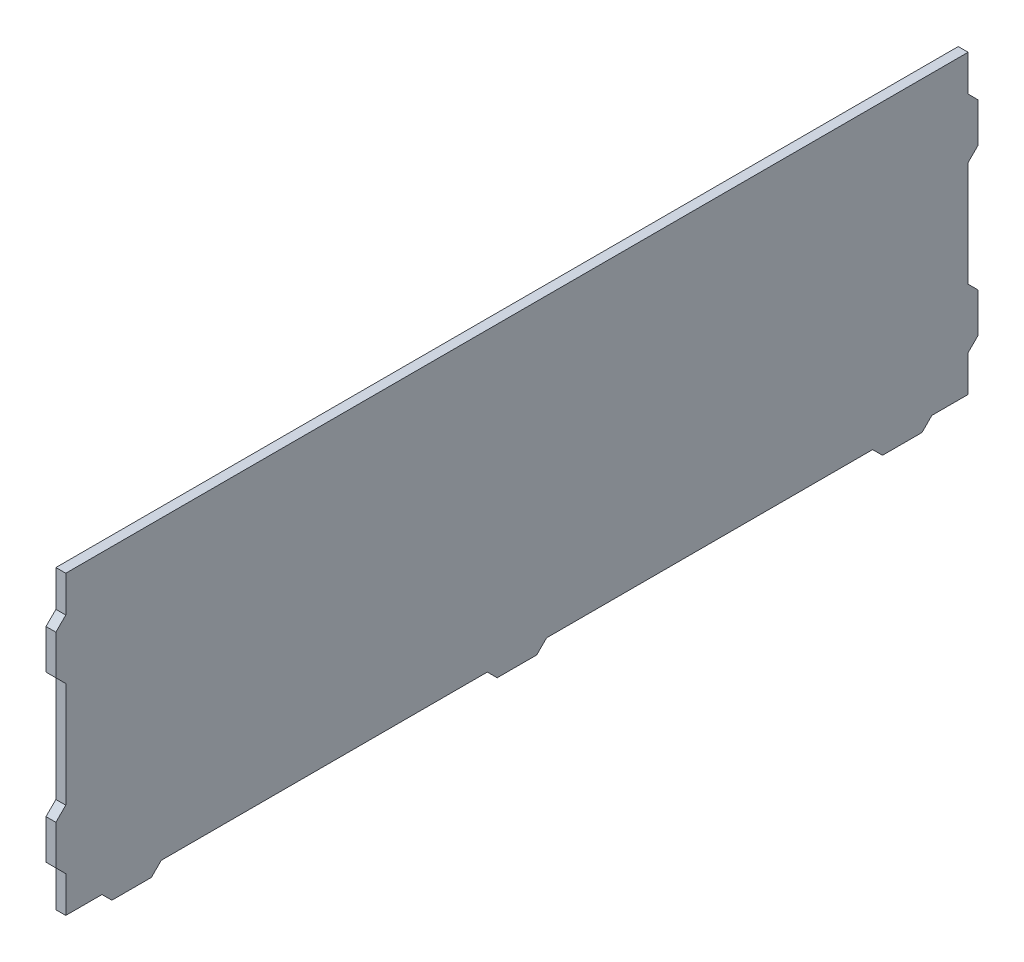
ISO-10303-21;
HEADER;
FILE_DESCRIPTION(('STEP AP214'),'2;1');
FILE_NAME('part.step','',(''),(''),'','','');
FILE_SCHEMA(('AUTOMOTIVE_DESIGN { 1 0 10303 214 1 1 1 1 }'));
ENDSEC;
DATA;
#1=APPLICATION_CONTEXT('core data for automotive mechanical design processes');
#2=APPLICATION_PROTOCOL_DEFINITION('international standard','automotive_design',2000,#1);
#3=PRODUCT_CONTEXT('',#1,'mechanical');
#4=PRODUCT('Part','Part','',(#3));
#5=PRODUCT_RELATED_PRODUCT_CATEGORY('part','',(#4));
#6=PRODUCT_DEFINITION_FORMATION('','',#4);
#7=PRODUCT_DEFINITION_CONTEXT('part definition',#1,'design');
#8=PRODUCT_DEFINITION('design','',#6,#7);
#9=PRODUCT_DEFINITION_SHAPE('','',#8);
#10=(LENGTH_UNIT() NAMED_UNIT(*) SI_UNIT(.MILLI.,.METRE.));
#11=(NAMED_UNIT(*) PLANE_ANGLE_UNIT() SI_UNIT($,.RADIAN.));
#12=(NAMED_UNIT(*) SI_UNIT($,.STERADIAN.) SOLID_ANGLE_UNIT());
#13=UNCERTAINTY_MEASURE_WITH_UNIT(LENGTH_MEASURE(1.E-05),#10,'distance_accuracy_value','');
#14=(GEOMETRIC_REPRESENTATION_CONTEXT(3) GLOBAL_UNCERTAINTY_ASSIGNED_CONTEXT((#13)) GLOBAL_UNIT_ASSIGNED_CONTEXT((#10,
#11,#12)) REPRESENTATION_CONTEXT('',''));
#15=CARTESIAN_POINT('',(0.,0.,0.));
#16=DIRECTION('',(0.,0.,1.));
#17=DIRECTION('',(1.,0.,0.));
#18=AXIS2_PLACEMENT_3D('',#15,#16,#17);
#19=CARTESIAN_POINT('',(1.5,0.,0.));
#20=DIRECTION('',(0.,1.,0.));
#21=DIRECTION('',(0.,0.,1.));
#22=AXIS2_PLACEMENT_3D('',#19,#20,#21);
#23=PLANE('',#22);
#24=DIRECTION('',(0.,0.,-1.));
#25=VECTOR('',#24,1.);
#26=CARTESIAN_POINT('',(0.,0.,0.));
#27=LINE('',#26,#25);
#28=CARTESIAN_POINT('',(0.,0.,0.));
#29=VERTEX_POINT('',#28);
#30=CARTESIAN_POINT('',(0.,-3.33066907387547E-13,-5.50000000000006));
#31=VERTEX_POINT('',#30);
#32=EDGE_CURVE('E554',#29,#31,#27,.T.);
#33=ORIENTED_EDGE('',*,*,#32,.T.);
#34=DIRECTION('',(1.,0.,0.));
#35=VECTOR('',#34,1.);
#36=CARTESIAN_POINT('',(0.750000000000056,-3.33066907387547E-13,-5.50000000000006));
#37=LINE('',#36,#35);
#38=CARTESIAN_POINT('',(1.50000000000006,-3.33066907387547E-13,-5.50000000000006));
#39=VERTEX_POINT('',#38);
#40=EDGE_CURVE('E342',#31,#39,#37,.T.);
#41=ORIENTED_EDGE('',*,*,#40,.T.);
#42=DIRECTION('',(0.,0.,-1.));
#43=VECTOR('',#42,1.);
#44=CARTESIAN_POINT('',(1.5,0.,0.));
#45=LINE('',#44,#43);
#46=CARTESIAN_POINT('',(1.5,0.,0.));
#47=VERTEX_POINT('',#46);
#48=EDGE_CURVE('E537',#47,#39,#45,.T.);
#49=ORIENTED_EDGE('',*,*,#48,.F.);
#50=DIRECTION('',(-1.,0.,0.));
#51=VECTOR('',#50,1.);
#52=CARTESIAN_POINT('',(1.5,0.,0.));
#53=LINE('',#52,#51);
#54=EDGE_CURVE('E13',#47,#29,#53,.T.);
#55=ORIENTED_EDGE('',*,*,#54,.T.);
#56=EDGE_LOOP('',(#33,#41,#49,#55));
#57=FACE_BOUND('',#56,.T.);
#58=ADVANCED_FACE('F126',(#57),#23,.F.);
#59=CARTESIAN_POINT('',(1.50000000000006,-1.11022302462516E-13,-14.5000000000001));
#60=VERTEX_POINT('',#59);
#61=CARTESIAN_POINT('',(1.50000000000006,-1.11022302462516E-13,-63.9999999999999));
#62=VERTEX_POINT('',#61);
#63=EDGE_CURVE('E541',#60,#62,#45,.T.);
#64=ORIENTED_EDGE('',*,*,#63,.F.);
#65=DIRECTION('',(-1.,0.,0.));
#66=VECTOR('',#65,1.);
#67=CARTESIAN_POINT('',(0.750000000000056,-1.11022302462516E-13,-14.5000000000001));
#68=LINE('',#67,#66);
#69=CARTESIAN_POINT('',(0.,-1.11022302462516E-13,-14.5000000000001));
#70=VERTEX_POINT('',#69);
#71=EDGE_CURVE('E347',#60,#70,#68,.T.);
#72=ORIENTED_EDGE('',*,*,#71,.T.);
#73=CARTESIAN_POINT('',(0.,-1.11022302462516E-13,-63.9999999999999));
#74=VERTEX_POINT('',#73);
#75=EDGE_CURVE('E557',#70,#74,#27,.T.);
#76=ORIENTED_EDGE('',*,*,#75,.T.);
#77=DIRECTION('',(1.,0.,0.));
#78=VECTOR('',#77,1.);
#79=CARTESIAN_POINT('',(0.750000000000056,-1.11022302462516E-13,-63.9999999999999));
#80=LINE('',#79,#78);
#81=EDGE_CURVE('E391',#74,#62,#80,.T.);
#82=ORIENTED_EDGE('',*,*,#81,.T.);
#83=EDGE_LOOP('',(#64,#72,#76,#82));
#84=FACE_BOUND('',#83,.T.);
#85=ADVANCED_FACE('F598',(#84),#23,.F.);
#86=CARTESIAN_POINT('',(1.50000000000006,-3.33066907387547E-13,-73.));
#87=VERTEX_POINT('',#86);
#88=CARTESIAN_POINT('',(1.50000000000006,-2.22044604925031E-13,-122.5));
#89=VERTEX_POINT('',#88);
#90=EDGE_CURVE('E587',#87,#89,#45,.T.);
#91=ORIENTED_EDGE('',*,*,#90,.F.);
#92=DIRECTION('',(-1.,0.,0.));
#93=VECTOR('',#92,1.);
#94=CARTESIAN_POINT('',(0.750000000000056,-3.33066907387547E-13,-73.));
#95=LINE('',#94,#93);
#96=CARTESIAN_POINT('',(0.,-3.33066907387547E-13,-73.));
#97=VERTEX_POINT('',#96);
#98=EDGE_CURVE('E389',#87,#97,#95,.T.);
#99=ORIENTED_EDGE('',*,*,#98,.T.);
#100=CARTESIAN_POINT('',(0.,-2.22044604925031E-13,-122.5));
#101=VERTEX_POINT('',#100);
#102=EDGE_CURVE('E599',#97,#101,#27,.T.);
#103=ORIENTED_EDGE('',*,*,#102,.T.);
#104=DIRECTION('',(1.,0.,0.));
#105=VECTOR('',#104,1.);
#106=CARTESIAN_POINT('',(0.750000000000056,-2.22044604925031E-13,-122.5));
#107=LINE('',#106,#105);
#108=EDGE_CURVE('E418',#101,#89,#107,.T.);
#109=ORIENTED_EDGE('',*,*,#108,.T.);
#110=EDGE_LOOP('',(#91,#99,#103,#109));
#111=FACE_BOUND('',#110,.T.);
#112=ADVANCED_FACE('F606',(#111),#23,.F.);
#113=CARTESIAN_POINT('',(1.5,0.,0.));
#114=DIRECTION('',(0.,0.,-1.));
#115=DIRECTION('',(-1.,0.,0.));
#116=AXIS2_PLACEMENT_3D('',#113,#114,#115);
#117=PLANE('',#116);
#118=DIRECTION('',(0.,-1.,0.));
#119=VECTOR('',#118,1.);
#120=CARTESIAN_POINT('',(1.5,0.,0.));
#121=LINE('',#120,#119);
#122=CARTESIAN_POINT('',(1.50000000000006,30.4999999999999,0.));
#123=VERTEX_POINT('',#122);
#124=CARTESIAN_POINT('',(1.50000000000006,14.4999999999996,2.22044604925031E-13));
#125=VERTEX_POINT('',#124);
#126=EDGE_CURVE('E535',#123,#125,#121,.T.);
#127=ORIENTED_EDGE('',*,*,#126,.F.);
#128=DIRECTION('',(1.,0.,0.));
#129=VECTOR('',#128,1.);
#130=CARTESIAN_POINT('',(0.750000000000056,30.4999999999999,0.));
#131=LINE('',#130,#129);
#132=CARTESIAN_POINT('',(0.,30.4999999999999,0.));
#133=VERTEX_POINT('',#132);
#134=EDGE_CURVE('E434',#123,#133,#131,.F.);
#135=ORIENTED_EDGE('',*,*,#134,.T.);
#136=DIRECTION('',(0.,-1.,0.));
#137=VECTOR('',#136,1.);
#138=CARTESIAN_POINT('',(0.,0.,0.));
#139=LINE('',#138,#137);
#140=CARTESIAN_POINT('',(0.,14.4999999999996,2.22044604925031E-13));
#141=VERTEX_POINT('',#140);
#142=EDGE_CURVE('E553',#133,#141,#139,.T.);
#143=ORIENTED_EDGE('',*,*,#142,.T.);
#144=DIRECTION('',(-1.,0.,0.));
#145=VECTOR('',#144,1.);
#146=CARTESIAN_POINT('',(0.750000000000056,14.4999999999996,2.22044604925031E-13));
#147=LINE('',#146,#145);
#148=EDGE_CURVE('E455',#141,#125,#147,.F.);
#149=ORIENTED_EDGE('',*,*,#148,.T.);
#150=EDGE_LOOP('',(#127,#135,#143,#149));
#151=FACE_BOUND('',#150,.T.);
#152=ADVANCED_FACE('F628',(#151),#117,.F.);
#153=CARTESIAN_POINT('',(1.50000000000006,5.49999999999984,-1.11022302462516E-13));
#154=VERTEX_POINT('',#153);
#155=EDGE_CURVE('E536',#154,#47,#121,.T.);
#156=ORIENTED_EDGE('',*,*,#155,.F.);
#157=DIRECTION('',(1.,0.,0.));
#158=VECTOR('',#157,1.);
#159=CARTESIAN_POINT('',(0.750000000000056,5.49999999999984,-1.11022302462516E-13));
#160=LINE('',#159,#158);
#161=CARTESIAN_POINT('',(0.,5.49999999999984,-1.11022302462516E-13));
#162=VERTEX_POINT('',#161);
#163=EDGE_CURVE('E460',#154,#162,#160,.F.);
#164=ORIENTED_EDGE('',*,*,#163,.T.);
#165=EDGE_CURVE('E530',#162,#29,#139,.T.);
#166=ORIENTED_EDGE('',*,*,#165,.T.);
#167=ORIENTED_EDGE('',*,*,#54,.F.);
#168=EDGE_LOOP('',(#156,#164,#166,#167));
#169=FACE_BOUND('',#168,.T.);
#170=ADVANCED_FACE('F629',(#169),#117,.F.);
#171=CARTESIAN_POINT('',(1.50000000000006,-1.11022302462516E-13,-137.));
#172=DIRECTION('',(0.,0.,1.));
#173=DIRECTION('',(1.,0.,0.));
#174=AXIS2_PLACEMENT_3D('',#171,#172,#173);
#175=PLANE('',#174);
#176=DIRECTION('',(0.,1.,0.));
#177=VECTOR('',#176,1.);
#178=CARTESIAN_POINT('',(1.50000000000006,-1.11022302462516E-13,-137.));
#179=LINE('',#178,#177);
#180=CARTESIAN_POINT('',(1.50000000000006,39.4999999999996,-137.));
#181=VERTEX_POINT('',#180);
#182=CARTESIAN_POINT('',(1.50000000000006,44.9999999999998,-137.000000000001));
#183=VERTEX_POINT('',#182);
#184=EDGE_CURVE('E540',#181,#183,#179,.T.);
#185=ORIENTED_EDGE('',*,*,#184,.F.);
#186=DIRECTION('',(-1.,0.,0.));
#187=VECTOR('',#186,1.);
#188=CARTESIAN_POINT('',(150.,39.4999999999998,-137.));
#189=LINE('',#188,#187);
#190=CARTESIAN_POINT('',(0.,39.4999999999996,-137.));
#191=VERTEX_POINT('',#190);
#192=EDGE_CURVE('E497',#181,#191,#189,.T.);
#193=ORIENTED_EDGE('',*,*,#192,.T.);
#194=DIRECTION('',(0.,1.,0.));
#195=VECTOR('',#194,1.);
#196=CARTESIAN_POINT('',(0.,-1.11022302462516E-13,-137.));
#197=LINE('',#196,#195);
#198=CARTESIAN_POINT('',(0.,44.9999999999998,-137.000000000001));
#199=VERTEX_POINT('',#198);
#200=EDGE_CURVE('E556',#191,#199,#197,.T.);
#201=ORIENTED_EDGE('',*,*,#200,.T.);
#202=DIRECTION('',(-1.,0.,0.));
#203=VECTOR('',#202,1.);
#204=CARTESIAN_POINT('',(1.50000000000006,44.9999999999998,-137.000000000001));
#205=LINE('',#204,#203);
#206=EDGE_CURVE('E566',#183,#199,#205,.T.);
#207=ORIENTED_EDGE('',*,*,#206,.F.);
#208=EDGE_LOOP('',(#185,#193,#201,#207));
#209=FACE_BOUND('',#208,.T.);
#210=ADVANCED_FACE('F625',(#209),#175,.F.);
#211=CARTESIAN_POINT('',(0.,14.4999999999997,-137.));
#212=VERTEX_POINT('',#211);
#213=CARTESIAN_POINT('',(0.,30.4999999999999,-137.));
#214=VERTEX_POINT('',#213);
#215=EDGE_CURVE('E562',#212,#214,#197,.T.);
#216=ORIENTED_EDGE('',*,*,#215,.T.);
#217=DIRECTION('',(1.,0.,0.));
#218=VECTOR('',#217,1.);
#219=CARTESIAN_POINT('',(150.,30.4999999999999,-137.));
#220=LINE('',#219,#218);
#221=CARTESIAN_POINT('',(1.50000000000006,30.4999999999999,-137.));
#222=VERTEX_POINT('',#221);
#223=EDGE_CURVE('E494',#214,#222,#220,.T.);
#224=ORIENTED_EDGE('',*,*,#223,.T.);
#225=CARTESIAN_POINT('',(1.50000000000006,14.4999999999997,-137.));
#226=VERTEX_POINT('',#225);
#227=EDGE_CURVE('E546',#226,#222,#179,.T.);
#228=ORIENTED_EDGE('',*,*,#227,.F.);
#229=DIRECTION('',(-1.,0.,0.));
#230=VECTOR('',#229,1.);
#231=CARTESIAN_POINT('',(150.,14.5000000000001,-137.000000000001));
#232=LINE('',#231,#230);
#233=EDGE_CURVE('E523',#226,#212,#232,.T.);
#234=ORIENTED_EDGE('',*,*,#233,.T.);
#235=EDGE_LOOP('',(#216,#224,#228,#234));
#236=FACE_BOUND('',#235,.T.);
#237=ADVANCED_FACE('F626',(#236),#175,.F.);
#238=CARTESIAN_POINT('',(0.,44.9999999999997,0.));
#239=VERTEX_POINT('',#238);
#240=CARTESIAN_POINT('',(0.,39.5,0.));
#241=VERTEX_POINT('',#240);
#242=EDGE_CURVE('E549',#239,#241,#139,.T.);
#243=ORIENTED_EDGE('',*,*,#242,.T.);
#244=DIRECTION('',(-1.,0.,0.));
#245=VECTOR('',#244,1.);
#246=CARTESIAN_POINT('',(0.750000000000056,39.5,0.));
#247=LINE('',#246,#245);
#248=CARTESIAN_POINT('',(1.50000000000006,39.5,0.));
#249=VERTEX_POINT('',#248);
#250=EDGE_CURVE('E429',#241,#249,#247,.F.);
#251=ORIENTED_EDGE('',*,*,#250,.T.);
#252=CARTESIAN_POINT('',(1.50000000000006,44.9999999999997,0.));
#253=VERTEX_POINT('',#252);
#254=EDGE_CURVE('E531',#253,#249,#121,.T.);
#255=ORIENTED_EDGE('',*,*,#254,.F.);
#256=DIRECTION('',(-1.,0.,0.));
#257=VECTOR('',#256,1.);
#258=CARTESIAN_POINT('',(1.50000000000006,44.9999999999997,0.));
#259=LINE('',#258,#257);
#260=EDGE_CURVE('E548',#253,#239,#259,.T.);
#261=ORIENTED_EDGE('',*,*,#260,.T.);
#262=EDGE_LOOP('',(#243,#251,#255,#261));
#263=FACE_BOUND('',#262,.T.);
#264=ADVANCED_FACE('F128',(#263),#117,.F.);
#265=CARTESIAN_POINT('',(1.50000000000006,0.,-131.5));
#266=VERTEX_POINT('',#265);
#267=CARTESIAN_POINT('',(1.50000000000006,-1.11022302462516E-13,-137.));
#268=VERTEX_POINT('',#267);
#269=EDGE_CURVE('E534',#266,#268,#45,.T.);
#270=ORIENTED_EDGE('',*,*,#269,.F.);
#271=DIRECTION('',(-1.,0.,0.));
#272=VECTOR('',#271,1.);
#273=CARTESIAN_POINT('',(0.750000000000056,0.,-131.5));
#274=LINE('',#273,#272);
#275=CARTESIAN_POINT('',(0.,0.,-131.5));
#276=VERTEX_POINT('',#275);
#277=EDGE_CURVE('E415',#266,#276,#274,.T.);
#278=ORIENTED_EDGE('',*,*,#277,.T.);
#279=CARTESIAN_POINT('',(0.,-1.11022302462516E-13,-137.));
#280=VERTEX_POINT('',#279);
#281=EDGE_CURVE('E552',#276,#280,#27,.T.);
#282=ORIENTED_EDGE('',*,*,#281,.T.);
#283=DIRECTION('',(-1.,0.,0.));
#284=VECTOR('',#283,1.);
#285=CARTESIAN_POINT('',(1.50000000000006,-1.11022302462516E-13,-137.));
#286=LINE('',#285,#284);
#287=EDGE_CURVE('E134',#268,#280,#286,.T.);
#288=ORIENTED_EDGE('',*,*,#287,.F.);
#289=EDGE_LOOP('',(#270,#278,#282,#288));
#290=FACE_BOUND('',#289,.T.);
#291=ADVANCED_FACE('F617',(#290),#23,.F.);
#292=CARTESIAN_POINT('',(0.,5.49999999999962,-137.));
#293=VERTEX_POINT('',#292);
#294=EDGE_CURVE('E558',#280,#293,#197,.T.);
#295=ORIENTED_EDGE('',*,*,#294,.T.);
#296=DIRECTION('',(1.,0.,0.));
#297=VECTOR('',#296,1.);
#298=CARTESIAN_POINT('',(150.,5.49999999999962,-137.));
#299=LINE('',#298,#297);
#300=CARTESIAN_POINT('',(1.50000000000006,5.49999999999962,-137.));
#301=VERTEX_POINT('',#300);
#302=EDGE_CURVE('E520',#293,#301,#299,.T.);
#303=ORIENTED_EDGE('',*,*,#302,.T.);
#304=EDGE_CURVE('E542',#268,#301,#179,.T.);
#305=ORIENTED_EDGE('',*,*,#304,.F.);
#306=ORIENTED_EDGE('',*,*,#287,.T.);
#307=EDGE_LOOP('',(#295,#303,#305,#306));
#308=FACE_BOUND('',#307,.T.);
#309=ADVANCED_FACE('F573',(#308),#175,.F.);
#310=CARTESIAN_POINT('',(1.50000000000006,44.9999999999997,0.));
#311=DIRECTION('',(0.,-1.,0.));
#312=DIRECTION('',(0.,0.,-1.));
#313=AXIS2_PLACEMENT_3D('',#310,#311,#312);
#314=PLANE('',#313);
#315=DIRECTION('',(0.,0.,1.));
#316=VECTOR('',#315,1.);
#317=CARTESIAN_POINT('',(0.,44.9999999999997,0.));
#318=LINE('',#317,#316);
#319=EDGE_CURVE('E561',#199,#239,#318,.T.);
#320=ORIENTED_EDGE('',*,*,#319,.T.);
#321=ORIENTED_EDGE('',*,*,#260,.F.);
#322=DIRECTION('',(0.,0.,1.));
#323=VECTOR('',#322,1.);
#324=CARTESIAN_POINT('',(1.50000000000006,44.9999999999997,0.));
#325=LINE('',#324,#323);
#326=EDGE_CURVE('E545',#183,#253,#325,.T.);
#327=ORIENTED_EDGE('',*,*,#326,.F.);
#328=ORIENTED_EDGE('',*,*,#206,.T.);
#329=EDGE_LOOP('',(#320,#321,#327,#328));
#330=FACE_BOUND('',#329,.T.);
#331=ADVANCED_FACE('F623',(#330),#314,.F.);
#332=CARTESIAN_POINT('',(1.5,0.,0.));
#333=DIRECTION('',(-1.,0.,0.));
#334=DIRECTION('',(0.,0.,1.));
#335=AXIS2_PLACEMENT_3D('',#332,#333,#334);
#336=PLANE('',#335);
#337=ORIENTED_EDGE('',*,*,#254,.T.);
#338=DIRECTION('',(0.,0.707106781186548,-0.707106781186548));
#339=VECTOR('',#338,1.);
#340=CARTESIAN_POINT('',(1.50000000000006,39.9999999999996,-0.499999999999945));
#341=LINE('',#340,#339);
#342=CARTESIAN_POINT('',(1.50000000000006,37.9999999999998,1.50000000000039));
#343=VERTEX_POINT('',#342);
#344=EDGE_CURVE('E447',#249,#343,#341,.F.);
#345=ORIENTED_EDGE('',*,*,#344,.T.);
#346=DIRECTION('',(0.,-1.,0.));
#347=VECTOR('',#346,1.);
#348=CARTESIAN_POINT('',(1.50000000000006,29.9999999999998,1.50000000000017));
#349=LINE('',#348,#347);
#350=CARTESIAN_POINT('',(1.50000000000006,31.9999999999999,1.49999999999983));
#351=VERTEX_POINT('',#350);
#352=EDGE_CURVE('E426',#343,#351,#349,.T.);
#353=ORIENTED_EDGE('',*,*,#352,.T.);
#354=DIRECTION('',(0.,0.707106781186547,0.707106781186548));
#355=VECTOR('',#354,1.);
#356=CARTESIAN_POINT('',(1.50000000000006,29.9999999999997,-0.499999999999501));
#357=LINE('',#356,#355);
#358=EDGE_CURVE('E449',#351,#123,#357,.F.);
#359=ORIENTED_EDGE('',*,*,#358,.T.);
#360=ORIENTED_EDGE('',*,*,#126,.T.);
#361=DIRECTION('',(0.,0.707106781186548,-0.707106781186548));
#362=VECTOR('',#361,1.);
#363=CARTESIAN_POINT('',(1.50000000000006,14.9999999999998,-0.499999999999501));
#364=LINE('',#363,#362);
#365=CARTESIAN_POINT('',(1.50000000000006,12.9999999999997,1.5000000000005));
#366=VERTEX_POINT('',#365);
#367=EDGE_CURVE('E474',#125,#366,#364,.F.);
#368=ORIENTED_EDGE('',*,*,#367,.T.);
#369=DIRECTION('',(0.,-1.,0.));
#370=VECTOR('',#369,1.);
#371=CARTESIAN_POINT('',(1.50000000000006,5.,1.49999999999983));
#372=LINE('',#371,#370);
#373=CARTESIAN_POINT('',(1.50000000000006,6.9999999999999,1.49999999999995));
#374=VERTEX_POINT('',#373);
#375=EDGE_CURVE('E452',#366,#374,#372,.T.);
#376=ORIENTED_EDGE('',*,*,#375,.T.);
#377=DIRECTION('',(0.,0.707106781186548,0.707106781186548));
#378=VECTOR('',#377,1.);
#379=CARTESIAN_POINT('',(1.50000000000006,4.99999999999978,-0.500000000000167));
#380=LINE('',#379,#378);
#381=EDGE_CURVE('E476',#374,#154,#380,.F.);
#382=ORIENTED_EDGE('',*,*,#381,.T.);
#383=ORIENTED_EDGE('',*,*,#155,.T.);
#384=ORIENTED_EDGE('',*,*,#48,.T.);
#385=DIRECTION('',(0.,-0.707106781186548,-0.707106781186548));
#386=VECTOR('',#385,1.);
#387=CARTESIAN_POINT('',(1.5,-1.5000000000005,-6.9999999999999));
#388=LINE('',#387,#386);
#389=CARTESIAN_POINT('',(1.5,-1.5000000000005,-6.9999999999999));
#390=VERTEX_POINT('',#389);
#391=EDGE_CURVE('E371',#39,#390,#388,.T.);
#392=ORIENTED_EDGE('',*,*,#391,.T.);
#393=DIRECTION('',(0.,0.,1.));
#394=VECTOR('',#393,1.);
#395=CARTESIAN_POINT('',(1.50000000000006,-1.49999999999995,-14.9999999999999));
#396=LINE('',#395,#394);
#397=CARTESIAN_POINT('',(1.50000000000006,-1.50000000000039,-12.9999999999999));
#398=VERTEX_POINT('',#397);
#399=EDGE_CURVE('E356',#398,#390,#396,.T.);
#400=ORIENTED_EDGE('',*,*,#399,.F.);
#401=DIRECTION('',(0.,0.70710678118655,-0.707106781186545));
#402=VECTOR('',#401,1.);
#403=CARTESIAN_POINT('',(1.50000000000006,-1.50000000000039,-12.9999999999999));
#404=LINE('',#403,#402);
#405=EDGE_CURVE('E369',#398,#60,#404,.T.);
#406=ORIENTED_EDGE('',*,*,#405,.T.);
#407=ORIENTED_EDGE('',*,*,#63,.T.);
#408=DIRECTION('',(0.,-0.707106781186547,-0.707106781186548));
#409=VECTOR('',#408,1.);
#410=CARTESIAN_POINT('',(1.50000000000006,-1.50000000000017,-65.5000000000002));
#411=LINE('',#410,#409);
#412=CARTESIAN_POINT('',(1.50000000000006,-1.50000000000017,-65.5000000000002));
#413=VERTEX_POINT('',#412);
#414=EDGE_CURVE('E396',#62,#413,#411,.T.);
#415=ORIENTED_EDGE('',*,*,#414,.T.);
#416=DIRECTION('',(0.,0.,1.));
#417=VECTOR('',#416,1.);
#418=CARTESIAN_POINT('',(1.50000000000006,-1.50000000000006,-73.5000000000001));
#419=LINE('',#418,#417);
#420=CARTESIAN_POINT('',(1.50000000000006,-1.50000000000028,-71.4999999999999));
#421=VERTEX_POINT('',#420);
#422=EDGE_CURVE('E374',#421,#413,#419,.T.);
#423=ORIENTED_EDGE('',*,*,#422,.F.);
#424=DIRECTION('',(0.,0.707106781186548,-0.707106781186548));
#425=VECTOR('',#424,1.);
#426=CARTESIAN_POINT('',(1.50000000000006,-1.50000000000028,-71.4999999999999));
#427=LINE('',#426,#425);
#428=EDGE_CURVE('E394',#421,#87,#427,.T.);
#429=ORIENTED_EDGE('',*,*,#428,.T.);
#430=ORIENTED_EDGE('',*,*,#90,.T.);
#431=DIRECTION('',(0.,-0.70710678118655,-0.707106781186546));
#432=VECTOR('',#431,1.);
#433=CARTESIAN_POINT('',(1.50000000000006,-1.50000000000006,-124.));
#434=LINE('',#433,#432);
#435=CARTESIAN_POINT('',(1.50000000000006,-1.50000000000006,-124.));
#436=VERTEX_POINT('',#435);
#437=EDGE_CURVE('E423',#89,#436,#434,.T.);
#438=ORIENTED_EDGE('',*,*,#437,.T.);
#439=DIRECTION('',(0.,0.,1.));
#440=VECTOR('',#439,1.);
#441=CARTESIAN_POINT('',(1.50000000000006,-1.50000000000017,-132.));
#442=LINE('',#441,#440);
#443=CARTESIAN_POINT('',(1.50000000000006,-1.50000000000006,-130.000000000001));
#444=VERTEX_POINT('',#443);
#445=EDGE_CURVE('E399',#444,#436,#442,.T.);
#446=ORIENTED_EDGE('',*,*,#445,.F.);
#447=DIRECTION('',(0.,0.707106781186548,-0.707106781186548));
#448=VECTOR('',#447,1.);
#449=CARTESIAN_POINT('',(1.50000000000006,-1.50000000000006,-130.000000000001));
#450=LINE('',#449,#448);
#451=EDGE_CURVE('E421',#444,#266,#450,.T.);
#452=ORIENTED_EDGE('',*,*,#451,.T.);
#453=ORIENTED_EDGE('',*,*,#269,.T.);
#454=ORIENTED_EDGE('',*,*,#304,.T.);
#455=DIRECTION('',(0.,0.707106781186547,-0.707106781186549));
#456=VECTOR('',#455,1.);
#457=CARTESIAN_POINT('',(1.50000000000006,6.74999999999981,-138.25));
#458=LINE('',#457,#456);
#459=CARTESIAN_POINT('',(1.50000000000006,6.99999999999978,-138.5));
#460=VERTEX_POINT('',#459);
#461=EDGE_CURVE('E516',#301,#460,#458,.T.);
#462=ORIENTED_EDGE('',*,*,#461,.T.);
#463=DIRECTION('',(0.,-1.,0.));
#464=VECTOR('',#463,1.);
#465=CARTESIAN_POINT('',(1.50000000000006,5.,-138.500000000001));
#466=LINE('',#465,#464);
#467=CARTESIAN_POINT('',(1.50000000000006,12.9999999999998,-138.5));
#468=VERTEX_POINT('',#467);
#469=EDGE_CURVE('E507',#468,#460,#466,.T.);
#470=ORIENTED_EDGE('',*,*,#469,.F.);
#471=DIRECTION('',(0.,0.707106781186547,0.707106781186549));
#472=VECTOR('',#471,1.);
#473=CARTESIAN_POINT('',(1.50000000000006,8.24999999999987,-143.25));
#474=LINE('',#473,#472);
#475=EDGE_CURVE('E518',#468,#226,#474,.T.);
#476=ORIENTED_EDGE('',*,*,#475,.T.);
#477=ORIENTED_EDGE('',*,*,#227,.T.);
#478=DIRECTION('',(0.,0.707106781186548,-0.707106781186548));
#479=VECTOR('',#478,1.);
#480=CARTESIAN_POINT('',(1.50000000000006,31.7499999999999,-138.25));
#481=LINE('',#480,#479);
#482=CARTESIAN_POINT('',(1.50000000000006,31.9999999999997,-138.5));
#483=VERTEX_POINT('',#482);
#484=EDGE_CURVE('E490',#222,#483,#481,.T.);
#485=ORIENTED_EDGE('',*,*,#484,.T.);
#486=DIRECTION('',(0.,-1.,0.));
#487=VECTOR('',#486,1.);
#488=CARTESIAN_POINT('',(1.50000000000006,29.9999999999999,-138.5));
#489=LINE('',#488,#487);
#490=CARTESIAN_POINT('',(1.50000000000006,37.9999999999998,-138.5));
#491=VERTEX_POINT('',#490);
#492=EDGE_CURVE('E481',#491,#483,#489,.T.);
#493=ORIENTED_EDGE('',*,*,#492,.F.);
#494=DIRECTION('',(0.,0.707106781186547,0.707106781186548));
#495=VECTOR('',#494,1.);
#496=CARTESIAN_POINT('',(1.50000000000006,33.2499999999997,-143.250000000001));
#497=LINE('',#496,#495);
#498=EDGE_CURVE('E492',#491,#181,#497,.T.);
#499=ORIENTED_EDGE('',*,*,#498,.T.);
#500=ORIENTED_EDGE('',*,*,#184,.T.);
#501=ORIENTED_EDGE('',*,*,#326,.T.);
#502=EDGE_LOOP('',(#337,#345,#353,#359,#360,#368,#376,#382,#383,#384,#392,#400,#406,#407,#415,
#423,#429,#430,#438,#446,#452,#453,#454,#462,#470,#476,#477,#485,#493,#499,#500,#501));
#503=FACE_BOUND('',#502,.T.);
#504=ADVANCED_FACE('F583',(#503),#336,.F.);
#505=CARTESIAN_POINT('',(0.,0.,0.));
#506=DIRECTION('',(-1.,0.,0.));
#507=DIRECTION('',(0.,0.,1.));
#508=AXIS2_PLACEMENT_3D('',#505,#506,#507);
#509=PLANE('',#508);
#510=ORIENTED_EDGE('',*,*,#242,.F.);
#511=ORIENTED_EDGE('',*,*,#319,.F.);
#512=ORIENTED_EDGE('',*,*,#200,.F.);
#513=DIRECTION('',(0.,-0.707106781186547,-0.707106781186548));
#514=VECTOR('',#513,1.);
#515=CARTESIAN_POINT('',(0.,38.2499999999998,-138.25));
#516=LINE('',#515,#514);
#517=CARTESIAN_POINT('',(0.,37.9999999999998,-138.5));
#518=VERTEX_POINT('',#517);
#519=EDGE_CURVE('E502',#191,#518,#516,.T.);
#520=ORIENTED_EDGE('',*,*,#519,.T.);
#521=DIRECTION('',(0.,1.,0.));
#522=VECTOR('',#521,1.);
#523=CARTESIAN_POINT('',(0.,39.9999999999995,-138.500000000001));
#524=LINE('',#523,#522);
#525=CARTESIAN_POINT('',(0.,31.9999999999997,-138.5));
#526=VERTEX_POINT('',#525);
#527=EDGE_CURVE('E478',#526,#518,#524,.T.);
#528=ORIENTED_EDGE('',*,*,#527,.F.);
#529=DIRECTION('',(0.,-0.707106781186548,0.707106781186548));
#530=VECTOR('',#529,1.);
#531=CARTESIAN_POINT('',(0.,36.7499999999998,-143.25));
#532=LINE('',#531,#530);
#533=EDGE_CURVE('E500',#526,#214,#532,.T.);
#534=ORIENTED_EDGE('',*,*,#533,.T.);
#535=ORIENTED_EDGE('',*,*,#215,.F.);
#536=DIRECTION('',(0.,-0.707106781186547,-0.707106781186549));
#537=VECTOR('',#536,1.);
#538=CARTESIAN_POINT('',(0.,13.2499999999997,-138.25));
#539=LINE('',#538,#537);
#540=CARTESIAN_POINT('',(0.,12.9999999999998,-138.5));
#541=VERTEX_POINT('',#540);
#542=EDGE_CURVE('E528',#212,#541,#539,.T.);
#543=ORIENTED_EDGE('',*,*,#542,.T.);
#544=DIRECTION('',(0.,1.,0.));
#545=VECTOR('',#544,1.);
#546=CARTESIAN_POINT('',(0.,15.,-138.5));
#547=LINE('',#546,#545);
#548=CARTESIAN_POINT('',(0.,6.99999999999978,-138.5));
#549=VERTEX_POINT('',#548);
#550=EDGE_CURVE('E504',#549,#541,#547,.T.);
#551=ORIENTED_EDGE('',*,*,#550,.F.);
#552=DIRECTION('',(0.,-0.707106781186547,0.707106781186549));
#553=VECTOR('',#552,1.);
#554=CARTESIAN_POINT('',(0.,11.7499999999998,-143.250000000001));
#555=LINE('',#554,#553);
#556=EDGE_CURVE('E526',#549,#293,#555,.T.);
#557=ORIENTED_EDGE('',*,*,#556,.T.);
#558=ORIENTED_EDGE('',*,*,#294,.F.);
#559=ORIENTED_EDGE('',*,*,#281,.F.);
#560=DIRECTION('',(0.,-0.707106781186548,0.707106781186548));
#561=VECTOR('',#560,1.);
#562=CARTESIAN_POINT('',(0.,-1.50000000000006,-130.000000000001));
#563=LINE('',#562,#561);
#564=CARTESIAN_POINT('',(0.,-1.50000000000006,-130.000000000001));
#565=VERTEX_POINT('',#564);
#566=EDGE_CURVE('E410',#276,#565,#563,.T.);
#567=ORIENTED_EDGE('',*,*,#566,.T.);
#568=DIRECTION('',(0.,0.,-1.));
#569=VECTOR('',#568,1.);
#570=CARTESIAN_POINT('',(0.,-1.50000000000006,-122.));
#571=LINE('',#570,#569);
#572=CARTESIAN_POINT('',(0.,-1.50000000000006,-124.));
#573=VERTEX_POINT('',#572);
#574=EDGE_CURVE('E398',#573,#565,#571,.T.);
#575=ORIENTED_EDGE('',*,*,#574,.F.);
#576=DIRECTION('',(0.,0.70710678118655,0.707106781186546));
#577=VECTOR('',#576,1.);
#578=CARTESIAN_POINT('',(0.,-1.50000000000006,-124.));
#579=LINE('',#578,#577);
#580=EDGE_CURVE('E412',#573,#101,#579,.T.);
#581=ORIENTED_EDGE('',*,*,#580,.T.);
#582=ORIENTED_EDGE('',*,*,#102,.F.);
#583=DIRECTION('',(0.,-0.707106781186548,0.707106781186548));
#584=VECTOR('',#583,1.);
#585=CARTESIAN_POINT('',(0.,-1.50000000000028,-71.4999999999999));
#586=LINE('',#585,#584);
#587=CARTESIAN_POINT('',(0.,-1.50000000000028,-71.4999999999999));
#588=VERTEX_POINT('',#587);
#589=EDGE_CURVE('E149',#97,#588,#586,.T.);
#590=ORIENTED_EDGE('',*,*,#589,.T.);
#591=DIRECTION('',(0.,0.,-1.));
#592=VECTOR('',#591,1.);
#593=CARTESIAN_POINT('',(0.,-1.49999999999995,-63.4999999999999));
#594=LINE('',#593,#592);
#595=CARTESIAN_POINT('',(0.,-1.50000000000017,-65.5000000000002));
#596=VERTEX_POINT('',#595);
#597=EDGE_CURVE('E373',#596,#588,#594,.T.);
#598=ORIENTED_EDGE('',*,*,#597,.F.);
#599=DIRECTION('',(0.,0.707106781186547,0.707106781186548));
#600=VECTOR('',#599,1.);
#601=CARTESIAN_POINT('',(0.,-1.50000000000017,-65.5000000000002));
#602=LINE('',#601,#600);
#603=EDGE_CURVE('E386',#596,#74,#602,.T.);
#604=ORIENTED_EDGE('',*,*,#603,.T.);
#605=ORIENTED_EDGE('',*,*,#75,.F.);
#606=DIRECTION('',(0.,-0.70710678118655,0.707106781186545));
#607=VECTOR('',#606,1.);
#608=CARTESIAN_POINT('',(0.,-1.50000000000039,-12.9999999999999));
#609=LINE('',#608,#607);
#610=CARTESIAN_POINT('',(0.,-1.50000000000039,-12.9999999999999));
#611=VERTEX_POINT('',#610);
#612=EDGE_CURVE('E141',#70,#611,#609,.T.);
#613=ORIENTED_EDGE('',*,*,#612,.T.);
#614=DIRECTION('',(0.,0.,-1.));
#615=VECTOR('',#614,1.);
#616=CARTESIAN_POINT('',(0.,-1.50000000000028,-4.99999999999989));
#617=LINE('',#616,#615);
#618=CARTESIAN_POINT('',(0.,-1.5000000000005,-6.9999999999999));
#619=VERTEX_POINT('',#618);
#620=EDGE_CURVE('E354',#619,#611,#617,.T.);
#621=ORIENTED_EDGE('',*,*,#620,.F.);
#622=DIRECTION('',(0.,0.707106781186548,0.707106781186548));
#623=VECTOR('',#622,1.);
#624=CARTESIAN_POINT('',(0.,-1.5000000000005,-6.9999999999999));
#625=LINE('',#624,#623);
#626=EDGE_CURVE('E337',#619,#31,#625,.T.);
#627=ORIENTED_EDGE('',*,*,#626,.T.);
#628=ORIENTED_EDGE('',*,*,#32,.F.);
#629=ORIENTED_EDGE('',*,*,#165,.F.);
#630=DIRECTION('',(0.,-0.707106781186548,-0.707106781186548));
#631=VECTOR('',#630,1.);
#632=CARTESIAN_POINT('',(0.,4.99999999999978,-0.500000000000167));
#633=LINE('',#632,#631);
#634=CARTESIAN_POINT('',(0.,6.9999999999999,1.49999999999995));
#635=VERTEX_POINT('',#634);
#636=EDGE_CURVE('E466',#162,#635,#633,.F.);
#637=ORIENTED_EDGE('',*,*,#636,.T.);
#638=DIRECTION('',(0.,1.,0.));
#639=VECTOR('',#638,1.);
#640=CARTESIAN_POINT('',(0.,14.9999999999999,1.50000000000017));
#641=LINE('',#640,#639);
#642=CARTESIAN_POINT('',(0.,12.9999999999997,1.5000000000005));
#643=VERTEX_POINT('',#642);
#644=EDGE_CURVE('E451',#635,#643,#641,.T.);
#645=ORIENTED_EDGE('',*,*,#644,.T.);
#646=DIRECTION('',(0.,-0.707106781186548,0.707106781186548));
#647=VECTOR('',#646,1.);
#648=CARTESIAN_POINT('',(0.,14.9999999999998,-0.499999999999501));
#649=LINE('',#648,#647);
#650=EDGE_CURVE('E463',#643,#141,#649,.F.);
#651=ORIENTED_EDGE('',*,*,#650,.T.);
#652=ORIENTED_EDGE('',*,*,#142,.F.);
#653=DIRECTION('',(0.,-0.707106781186547,-0.707106781186548));
#654=VECTOR('',#653,1.);
#655=CARTESIAN_POINT('',(0.,29.9999999999997,-0.499999999999501));
#656=LINE('',#655,#654);
#657=CARTESIAN_POINT('',(0.,31.9999999999999,1.49999999999983));
#658=VERTEX_POINT('',#657);
#659=EDGE_CURVE('E439',#133,#658,#656,.F.);
#660=ORIENTED_EDGE('',*,*,#659,.T.);
#661=DIRECTION('',(0.,1.,0.));
#662=VECTOR('',#661,1.);
#663=CARTESIAN_POINT('',(0.,39.9999999999996,1.50000000000028));
#664=LINE('',#663,#662);
#665=CARTESIAN_POINT('',(0.,37.9999999999998,1.50000000000039));
#666=VERTEX_POINT('',#665);
#667=EDGE_CURVE('E425',#658,#666,#664,.T.);
#668=ORIENTED_EDGE('',*,*,#667,.T.);
#669=DIRECTION('',(0.,-0.707106781186548,0.707106781186548));
#670=VECTOR('',#669,1.);
#671=CARTESIAN_POINT('',(0.,39.9999999999996,-0.499999999999945));
#672=LINE('',#671,#670);
#673=EDGE_CURVE('E437',#666,#241,#672,.F.);
#674=ORIENTED_EDGE('',*,*,#673,.T.);
#675=EDGE_LOOP('',(#510,#511,#512,#520,#528,#534,#535,#543,#551,#557,#558,#559,#567,#575,#581,
#582,#590,#598,#604,#605,#613,#621,#627,#628,#629,#637,#645,#651,#652,#660,#668,#674));
#676=FACE_BOUND('',#675,.T.);
#677=ADVANCED_FACE('F360',(#676),#509,.T.);
#678=CARTESIAN_POINT('',(150.,-1.50000000000017,-138.5));
#679=DIRECTION('',(0.,0.,1.));
#680=DIRECTION('',(1.,0.,0.));
#681=AXIS2_PLACEMENT_3D('',#678,#679,#680);
#682=PLANE('',#681);
#683=ORIENTED_EDGE('',*,*,#550,.T.);
#684=DIRECTION('',(1.,0.,0.));
#685=VECTOR('',#684,1.);
#686=CARTESIAN_POINT('',(1.50000000000006,12.9999999999998,-138.5));
#687=LINE('',#686,#685);
#688=EDGE_CURVE('E513',#541,#468,#687,.T.);
#689=ORIENTED_EDGE('',*,*,#688,.T.);
#690=ORIENTED_EDGE('',*,*,#469,.T.);
#691=DIRECTION('',(-1.,0.,0.));
#692=VECTOR('',#691,1.);
#693=CARTESIAN_POINT('',(0.,6.99999999999978,-138.5));
#694=LINE('',#693,#692);
#695=EDGE_CURVE('E510',#460,#549,#694,.T.);
#696=ORIENTED_EDGE('',*,*,#695,.T.);
#697=EDGE_LOOP('',(#683,#689,#690,#696));
#698=FACE_BOUND('',#697,.T.);
#699=ADVANCED_FACE('F728',(#698),#682,.F.);
#700=CARTESIAN_POINT('',(150.,12.9999999999998,-138.5));
#701=DIRECTION('',(0.,0.707106781186549,-0.707106781186547));
#702=DIRECTION('',(-1.,0.,0.));
#703=AXIS2_PLACEMENT_3D('',#700,#701,#702);
#704=PLANE('',#703);
#705=ORIENTED_EDGE('',*,*,#542,.F.);
#706=ORIENTED_EDGE('',*,*,#233,.F.);
#707=ORIENTED_EDGE('',*,*,#475,.F.);
#708=ORIENTED_EDGE('',*,*,#688,.F.);
#709=EDGE_LOOP('',(#705,#706,#707,#708));
#710=FACE_BOUND('',#709,.T.);
#711=ADVANCED_FACE('F731',(#710),#704,.T.);
#712=CARTESIAN_POINT('',(150.,6.99999999999978,-138.5));
#713=DIRECTION('',(0.,-0.707106781186549,-0.707106781186547));
#714=DIRECTION('',(1.,0.,0.));
#715=AXIS2_PLACEMENT_3D('',#712,#713,#714);
#716=PLANE('',#715);
#717=ORIENTED_EDGE('',*,*,#461,.F.);
#718=ORIENTED_EDGE('',*,*,#302,.F.);
#719=ORIENTED_EDGE('',*,*,#556,.F.);
#720=ORIENTED_EDGE('',*,*,#695,.F.);
#721=EDGE_LOOP('',(#717,#718,#719,#720));
#722=FACE_BOUND('',#721,.T.);
#723=ADVANCED_FACE('F581',(#722),#716,.T.);
#724=CARTESIAN_POINT('',(150.,-1.50000000000017,-138.5));
#725=DIRECTION('',(0.,0.,1.));
#726=DIRECTION('',(1.,0.,0.));
#727=AXIS2_PLACEMENT_3D('',#724,#725,#726);
#728=PLANE('',#727);
#729=ORIENTED_EDGE('',*,*,#527,.T.);
#730=DIRECTION('',(1.,0.,0.));
#731=VECTOR('',#730,1.);
#732=CARTESIAN_POINT('',(1.50000000000006,37.9999999999998,-138.5));
#733=LINE('',#732,#731);
#734=EDGE_CURVE('E487',#518,#491,#733,.T.);
#735=ORIENTED_EDGE('',*,*,#734,.T.);
#736=ORIENTED_EDGE('',*,*,#492,.T.);
#737=DIRECTION('',(-1.,0.,0.));
#738=VECTOR('',#737,1.);
#739=CARTESIAN_POINT('',(0.,31.9999999999997,-138.5));
#740=LINE('',#739,#738);
#741=EDGE_CURVE('E484',#483,#526,#740,.T.);
#742=ORIENTED_EDGE('',*,*,#741,.T.);
#743=EDGE_LOOP('',(#729,#735,#736,#742));
#744=FACE_BOUND('',#743,.T.);
#745=ADVANCED_FACE('F717',(#744),#728,.F.);
#746=CARTESIAN_POINT('',(150.,37.9999999999998,-138.5));
#747=DIRECTION('',(0.,0.707106781186548,-0.707106781186547));
#748=DIRECTION('',(-1.,0.,0.));
#749=AXIS2_PLACEMENT_3D('',#746,#747,#748);
#750=PLANE('',#749);
#751=ORIENTED_EDGE('',*,*,#519,.F.);
#752=ORIENTED_EDGE('',*,*,#192,.F.);
#753=ORIENTED_EDGE('',*,*,#498,.F.);
#754=ORIENTED_EDGE('',*,*,#734,.F.);
#755=EDGE_LOOP('',(#751,#752,#753,#754));
#756=FACE_BOUND('',#755,.T.);
#757=ADVANCED_FACE('F720',(#756),#750,.T.);
#758=CARTESIAN_POINT('',(150.,31.9999999999997,-138.5));
#759=DIRECTION('',(0.,-0.707106781186548,-0.707106781186548));
#760=DIRECTION('',(1.,0.,0.));
#761=AXIS2_PLACEMENT_3D('',#758,#759,#760);
#762=PLANE('',#761);
#763=ORIENTED_EDGE('',*,*,#484,.F.);
#764=ORIENTED_EDGE('',*,*,#223,.F.);
#765=ORIENTED_EDGE('',*,*,#533,.F.);
#766=ORIENTED_EDGE('',*,*,#741,.F.);
#767=EDGE_LOOP('',(#763,#764,#765,#766));
#768=FACE_BOUND('',#767,.T.);
#769=ADVANCED_FACE('F709',(#768),#762,.T.);
#770=CARTESIAN_POINT('',(150.,-1.50000000000028,1.50000000000017));
#771=DIRECTION('',(0.,0.,-1.));
#772=DIRECTION('',(1.,0.,0.));
#773=AXIS2_PLACEMENT_3D('',#770,#771,#772);
#774=PLANE('',#773);
#775=ORIENTED_EDGE('',*,*,#644,.F.);
#776=DIRECTION('',(1.,0.,0.));
#777=VECTOR('',#776,1.);
#778=CARTESIAN_POINT('',(150.,6.9999999999999,1.49999999999995));
#779=LINE('',#778,#777);
#780=EDGE_CURVE('E471',#635,#374,#779,.T.);
#781=ORIENTED_EDGE('',*,*,#780,.T.);
#782=ORIENTED_EDGE('',*,*,#375,.F.);
#783=DIRECTION('',(-1.,0.,0.));
#784=VECTOR('',#783,1.);
#785=CARTESIAN_POINT('',(150.,12.9999999999997,1.5000000000005));
#786=LINE('',#785,#784);
#787=EDGE_CURVE('E468',#366,#643,#786,.T.);
#788=ORIENTED_EDGE('',*,*,#787,.T.);
#789=EDGE_LOOP('',(#775,#781,#782,#788));
#790=FACE_BOUND('',#789,.T.);
#791=ADVANCED_FACE('F705',(#790),#774,.F.);
#792=CARTESIAN_POINT('',(0.,4.99999999999978,-0.500000000000167));
#793=DIRECTION('',(0.,0.707106781186548,-0.707106781186548));
#794=DIRECTION('',(-1.,0.,0.));
#795=AXIS2_PLACEMENT_3D('',#792,#793,#794);
#796=PLANE('',#795);
#797=ORIENTED_EDGE('',*,*,#381,.F.);
#798=ORIENTED_EDGE('',*,*,#780,.F.);
#799=ORIENTED_EDGE('',*,*,#636,.F.);
#800=ORIENTED_EDGE('',*,*,#163,.F.);
#801=EDGE_LOOP('',(#797,#798,#799,#800));
#802=FACE_BOUND('',#801,.T.);
#803=ADVANCED_FACE('F708',(#802),#796,.F.);
#804=CARTESIAN_POINT('',(1.50000000000006,14.9999999999998,-0.499999999999501));
#805=DIRECTION('',(0.,-0.707106781186548,-0.707106781186548));
#806=DIRECTION('',(1.,0.,0.));
#807=AXIS2_PLACEMENT_3D('',#804,#805,#806);
#808=PLANE('',#807);
#809=ORIENTED_EDGE('',*,*,#650,.F.);
#810=ORIENTED_EDGE('',*,*,#787,.F.);
#811=ORIENTED_EDGE('',*,*,#367,.F.);
#812=ORIENTED_EDGE('',*,*,#148,.F.);
#813=EDGE_LOOP('',(#809,#810,#811,#812));
#814=FACE_BOUND('',#813,.T.);
#815=ADVANCED_FACE('F697',(#814),#808,.F.);
#816=CARTESIAN_POINT('',(150.,-1.50000000000028,1.50000000000017));
#817=DIRECTION('',(0.,0.,-1.));
#818=DIRECTION('',(1.,0.,0.));
#819=AXIS2_PLACEMENT_3D('',#816,#817,#818);
#820=PLANE('',#819);
#821=ORIENTED_EDGE('',*,*,#667,.F.);
#822=DIRECTION('',(1.,0.,0.));
#823=VECTOR('',#822,1.);
#824=CARTESIAN_POINT('',(150.,31.9999999999999,1.49999999999983));
#825=LINE('',#824,#823);
#826=EDGE_CURVE('E444',#658,#351,#825,.T.);
#827=ORIENTED_EDGE('',*,*,#826,.T.);
#828=ORIENTED_EDGE('',*,*,#352,.F.);
#829=DIRECTION('',(-1.,0.,0.));
#830=VECTOR('',#829,1.);
#831=CARTESIAN_POINT('',(150.,37.9999999999998,1.50000000000039));
#832=LINE('',#831,#830);
#833=EDGE_CURVE('E441',#343,#666,#832,.T.);
#834=ORIENTED_EDGE('',*,*,#833,.T.);
#835=EDGE_LOOP('',(#821,#827,#828,#834));
#836=FACE_BOUND('',#835,.T.);
#837=ADVANCED_FACE('F693',(#836),#820,.F.);
#838=CARTESIAN_POINT('',(0.,29.9999999999997,-0.499999999999501));
#839=DIRECTION('',(0.,0.707106781186548,-0.707106781186547));
#840=DIRECTION('',(-1.,0.,0.));
#841=AXIS2_PLACEMENT_3D('',#838,#839,#840);
#842=PLANE('',#841);
#843=ORIENTED_EDGE('',*,*,#358,.F.);
#844=ORIENTED_EDGE('',*,*,#826,.F.);
#845=ORIENTED_EDGE('',*,*,#659,.F.);
#846=ORIENTED_EDGE('',*,*,#134,.F.);
#847=EDGE_LOOP('',(#843,#844,#845,#846));
#848=FACE_BOUND('',#847,.T.);
#849=ADVANCED_FACE('F696',(#848),#842,.F.);
#850=CARTESIAN_POINT('',(1.50000000000006,39.9999999999996,-0.499999999999945));
#851=DIRECTION('',(0.,-0.707106781186548,-0.707106781186548));
#852=DIRECTION('',(1.,0.,0.));
#853=AXIS2_PLACEMENT_3D('',#850,#851,#852);
#854=PLANE('',#853);
#855=ORIENTED_EDGE('',*,*,#673,.F.);
#856=ORIENTED_EDGE('',*,*,#833,.F.);
#857=ORIENTED_EDGE('',*,*,#344,.F.);
#858=ORIENTED_EDGE('',*,*,#250,.F.);
#859=EDGE_LOOP('',(#855,#856,#857,#858));
#860=FACE_BOUND('',#859,.T.);
#861=ADVANCED_FACE('F688',(#860),#854,.F.);
#862=CARTESIAN_POINT('',(-199.169350784858,-1.5000000000005,342.373007216458));
#863=DIRECTION('',(0.,-1.,0.));
#864=DIRECTION('',(0.,0.,-1.));
#865=AXIS2_PLACEMENT_3D('',#862,#863,#864);
#866=PLANE('',#865);
#867=ORIENTED_EDGE('',*,*,#445,.T.);
#868=DIRECTION('',(-1.,0.,0.));
#869=VECTOR('',#868,1.);
#870=CARTESIAN_POINT('',(0.,-1.50000000000006,-124.));
#871=LINE('',#870,#869);
#872=EDGE_CURVE('E407',#436,#573,#871,.T.);
#873=ORIENTED_EDGE('',*,*,#872,.T.);
#874=ORIENTED_EDGE('',*,*,#574,.T.);
#875=DIRECTION('',(1.,0.,0.));
#876=VECTOR('',#875,1.);
#877=CARTESIAN_POINT('',(1.50000000000006,-1.50000000000006,-130.000000000001));
#878=LINE('',#877,#876);
#879=EDGE_CURVE('E402',#565,#444,#878,.T.);
#880=ORIENTED_EDGE('',*,*,#879,.T.);
#881=EDGE_LOOP('',(#867,#873,#874,#880));
#882=FACE_BOUND('',#881,.T.);
#883=ADVANCED_FACE('F612',(#882),#866,.T.);
#884=CARTESIAN_POINT('',(-199.169350784858,-1.50000000000006,-124.));
#885=DIRECTION('',(0.,-0.707106781186546,0.70710678118655));
#886=DIRECTION('',(1.,0.,0.));
#887=AXIS2_PLACEMENT_3D('',#884,#885,#886);
#888=PLANE('',#887);
#889=ORIENTED_EDGE('',*,*,#437,.F.);
#890=ORIENTED_EDGE('',*,*,#108,.F.);
#891=ORIENTED_EDGE('',*,*,#580,.F.);
#892=ORIENTED_EDGE('',*,*,#872,.F.);
#893=EDGE_LOOP('',(#889,#890,#891,#892));
#894=FACE_BOUND('',#893,.T.);
#895=ADVANCED_FACE('F609',(#894),#888,.T.);
#896=CARTESIAN_POINT('',(-199.169350784858,-1.50000000000006,-130.000000000001));
#897=DIRECTION('',(0.,-0.707106781186548,-0.707106781186548));
#898=DIRECTION('',(-1.,0.,0.));
#899=AXIS2_PLACEMENT_3D('',#896,#897,#898);
#900=PLANE('',#899);
#901=ORIENTED_EDGE('',*,*,#566,.F.);
#902=ORIENTED_EDGE('',*,*,#277,.F.);
#903=ORIENTED_EDGE('',*,*,#451,.F.);
#904=ORIENTED_EDGE('',*,*,#879,.F.);
#905=EDGE_LOOP('',(#901,#902,#903,#904));
#906=FACE_BOUND('',#905,.T.);
#907=ADVANCED_FACE('F616',(#906),#900,.T.);
#908=CARTESIAN_POINT('',(-199.169350784858,-1.5000000000005,342.373007216458));
#909=DIRECTION('',(0.,-1.,0.));
#910=DIRECTION('',(0.,0.,-1.));
#911=AXIS2_PLACEMENT_3D('',#908,#909,#910);
#912=PLANE('',#911);
#913=ORIENTED_EDGE('',*,*,#422,.T.);
#914=DIRECTION('',(-1.,0.,0.));
#915=VECTOR('',#914,1.);
#916=CARTESIAN_POINT('',(0.,-1.50000000000017,-65.5000000000002));
#917=LINE('',#916,#915);
#918=EDGE_CURVE('E382',#413,#596,#917,.T.);
#919=ORIENTED_EDGE('',*,*,#918,.T.);
#920=ORIENTED_EDGE('',*,*,#597,.T.);
#921=DIRECTION('',(1.,0.,0.));
#922=VECTOR('',#921,1.);
#923=CARTESIAN_POINT('',(1.50000000000006,-1.50000000000028,-71.4999999999999));
#924=LINE('',#923,#922);
#925=EDGE_CURVE('E377',#588,#421,#924,.T.);
#926=ORIENTED_EDGE('',*,*,#925,.T.);
#927=EDGE_LOOP('',(#913,#919,#920,#926));
#928=FACE_BOUND('',#927,.T.);
#929=ADVANCED_FACE('F602',(#928),#912,.T.);
#930=CARTESIAN_POINT('',(-199.169350784858,-1.50000000000017,-65.5000000000002));
#931=DIRECTION('',(0.,-0.707106781186548,0.707106781186547));
#932=DIRECTION('',(1.,0.,0.));
#933=AXIS2_PLACEMENT_3D('',#930,#931,#932);
#934=PLANE('',#933);
#935=ORIENTED_EDGE('',*,*,#414,.F.);
#936=ORIENTED_EDGE('',*,*,#81,.F.);
#937=ORIENTED_EDGE('',*,*,#603,.F.);
#938=ORIENTED_EDGE('',*,*,#918,.F.);
#939=EDGE_LOOP('',(#935,#936,#937,#938));
#940=FACE_BOUND('',#939,.T.);
#941=ADVANCED_FACE('F597',(#940),#934,.T.);
#942=CARTESIAN_POINT('',(-199.169350784858,-1.50000000000028,-71.4999999999999));
#943=DIRECTION('',(0.,-0.707106781186548,-0.707106781186548));
#944=DIRECTION('',(-1.,0.,0.));
#945=AXIS2_PLACEMENT_3D('',#942,#943,#944);
#946=PLANE('',#945);
#947=ORIENTED_EDGE('',*,*,#589,.F.);
#948=ORIENTED_EDGE('',*,*,#98,.F.);
#949=ORIENTED_EDGE('',*,*,#428,.F.);
#950=ORIENTED_EDGE('',*,*,#925,.F.);
#951=EDGE_LOOP('',(#947,#948,#949,#950));
#952=FACE_BOUND('',#951,.T.);
#953=ADVANCED_FACE('F603',(#952),#946,.T.);
#954=CARTESIAN_POINT('',(-199.169350784858,-1.5000000000005,342.373007216458));
#955=DIRECTION('',(0.,-1.,0.));
#956=DIRECTION('',(0.,0.,-1.));
#957=AXIS2_PLACEMENT_3D('',#954,#955,#956);
#958=PLANE('',#957);
#959=ORIENTED_EDGE('',*,*,#399,.T.);
#960=DIRECTION('',(-1.,0.,0.));
#961=VECTOR('',#960,1.);
#962=CARTESIAN_POINT('',(0.,-1.5000000000005,-6.9999999999999));
#963=LINE('',#962,#961);
#964=EDGE_CURVE('E340',#390,#619,#963,.T.);
#965=ORIENTED_EDGE('',*,*,#964,.T.);
#966=ORIENTED_EDGE('',*,*,#620,.T.);
#967=DIRECTION('',(1.,0.,0.));
#968=VECTOR('',#967,1.);
#969=CARTESIAN_POINT('',(1.50000000000006,-1.50000000000039,-12.9999999999999));
#970=LINE('',#969,#968);
#971=EDGE_CURVE('E357',#611,#398,#970,.T.);
#972=ORIENTED_EDGE('',*,*,#971,.T.);
#973=EDGE_LOOP('',(#959,#965,#966,#972));
#974=FACE_BOUND('',#973,.T.);
#975=ADVANCED_FACE('F352',(#974),#958,.T.);
#976=CARTESIAN_POINT('',(-199.169350784858,-1.5000000000005,-6.9999999999999));
#977=DIRECTION('',(0.,-0.707106781186548,0.707106781186548));
#978=DIRECTION('',(1.,0.,0.));
#979=AXIS2_PLACEMENT_3D('',#976,#977,#978);
#980=PLANE('',#979);
#981=ORIENTED_EDGE('',*,*,#391,.F.);
#982=ORIENTED_EDGE('',*,*,#40,.F.);
#983=ORIENTED_EDGE('',*,*,#626,.F.);
#984=ORIENTED_EDGE('',*,*,#964,.F.);
#985=EDGE_LOOP('',(#981,#982,#983,#984));
#986=FACE_BOUND('',#985,.T.);
#987=ADVANCED_FACE('F339',(#986),#980,.T.);
#988=CARTESIAN_POINT('',(-199.169350784858,-1.50000000000039,-12.9999999999999));
#989=DIRECTION('',(0.,-0.707106781186545,-0.70710678118655));
#990=DIRECTION('',(-1.,0.,0.));
#991=AXIS2_PLACEMENT_3D('',#988,#989,#990);
#992=PLANE('',#991);
#993=ORIENTED_EDGE('',*,*,#612,.F.);
#994=ORIENTED_EDGE('',*,*,#71,.F.);
#995=ORIENTED_EDGE('',*,*,#405,.F.);
#996=ORIENTED_EDGE('',*,*,#971,.F.);
#997=EDGE_LOOP('',(#993,#994,#995,#996));
#998=FACE_BOUND('',#997,.T.);
#999=ADVANCED_FACE('F672',(#998),#992,.T.);
#1000=CLOSED_SHELL('',(#58,#85,#112,#152,#170,#210,#237,#264,#291,#309,#331,#504,#677,#699,#711,
#723,#745,#757,#769,#791,#803,#815,#837,#849,#861,#883,#895,#907,#929,#941,#953,#975,#987,#999));
#1001=MANIFOLD_SOLID_BREP('B2',#1000);
#1002=ADVANCED_BREP_SHAPE_REPRESENTATION('',(#18,#1001),#14);
#1003=SHAPE_DEFINITION_REPRESENTATION(#9,#1002);
ENDSEC;
END-ISO-10303-21;
